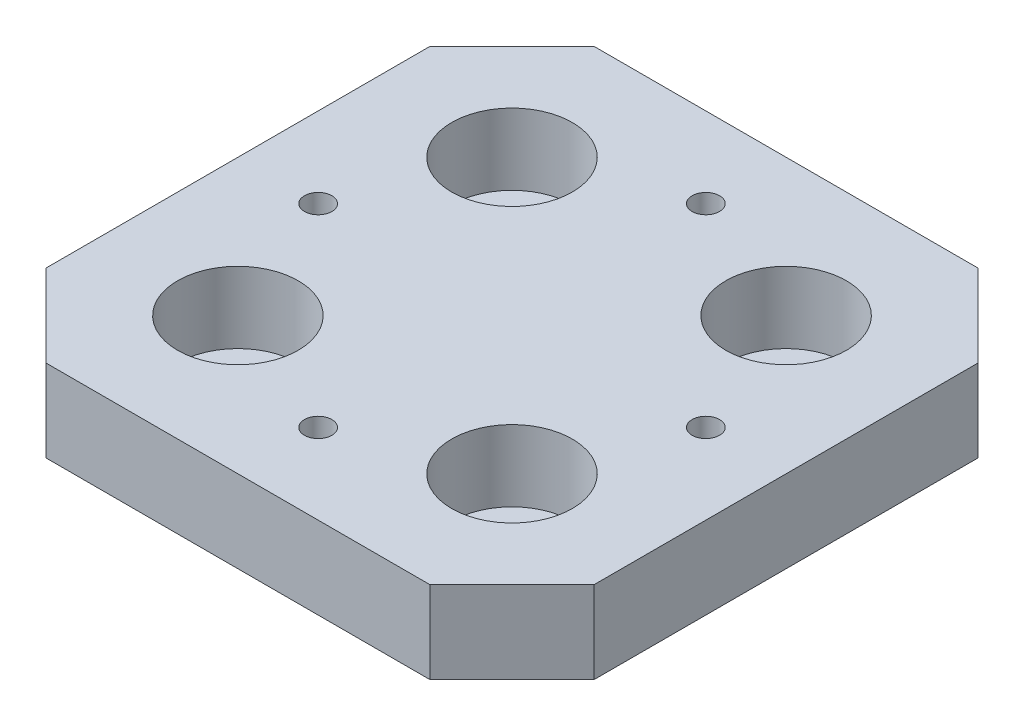
ISO-10303-21;
HEADER;
FILE_DESCRIPTION(('STEP AP214'),'2;1');
FILE_NAME('part.step','',(''),(''),'','','');
FILE_SCHEMA(('AUTOMOTIVE_DESIGN { 1 0 10303 214 1 1 1 1 }'));
ENDSEC;
DATA;
#1=APPLICATION_CONTEXT('core data for automotive mechanical design processes');
#2=APPLICATION_PROTOCOL_DEFINITION('international standard','automotive_design',2000,#1);
#3=PRODUCT_CONTEXT('',#1,'mechanical');
#4=PRODUCT('Part','Part','',(#3));
#5=PRODUCT_RELATED_PRODUCT_CATEGORY('part','',(#4));
#6=PRODUCT_DEFINITION_FORMATION('','',#4);
#7=PRODUCT_DEFINITION_CONTEXT('part definition',#1,'design');
#8=PRODUCT_DEFINITION('design','',#6,#7);
#9=PRODUCT_DEFINITION_SHAPE('','',#8);
#10=(LENGTH_UNIT() NAMED_UNIT(*) SI_UNIT(.MILLI.,.METRE.));
#11=(NAMED_UNIT(*) PLANE_ANGLE_UNIT() SI_UNIT($,.RADIAN.));
#12=(NAMED_UNIT(*) SI_UNIT($,.STERADIAN.) SOLID_ANGLE_UNIT());
#13=UNCERTAINTY_MEASURE_WITH_UNIT(LENGTH_MEASURE(1.E-05),#10,'distance_accuracy_value','');
#14=(GEOMETRIC_REPRESENTATION_CONTEXT(3) GLOBAL_UNCERTAINTY_ASSIGNED_CONTEXT((#13)) GLOBAL_UNIT_ASSIGNED_CONTEXT((#10,
#11,#12)) REPRESENTATION_CONTEXT('',''));
#15=CARTESIAN_POINT('',(0.,0.,0.));
#16=DIRECTION('',(0.,0.,1.));
#17=DIRECTION('',(1.,0.,0.));
#18=AXIS2_PLACEMENT_3D('',#15,#16,#17);
#19=CARTESIAN_POINT('',(0.,7.5,0.));
#20=DIRECTION('',(0.,-1.,0.));
#21=DIRECTION('',(0.,0.,-1.));
#22=AXIS2_PLACEMENT_3D('',#19,#20,#21);
#23=PLANE('',#22);
#24=CARTESIAN_POINT('',(-12.5,7.5,12.5));
#25=DIRECTION('',(0.,1.,0.));
#26=DIRECTION('',(0.,0.,1.));
#27=AXIS2_PLACEMENT_3D('',#24,#25,#26);
#28=CIRCLE('',#27,5.5);
#29=CARTESIAN_POINT('',(-12.5,7.5,18.));
#30=VERTEX_POINT('',#29);
#31=EDGE_CURVE('E229',#30,#30,#28,.T.);
#32=ORIENTED_EDGE('',*,*,#31,.F.);
#33=EDGE_LOOP('',(#32));
#34=FACE_BOUND('',#33,.T.);
#35=CARTESIAN_POINT('',(-12.5,7.5,-12.5));
#36=DIRECTION('',(0.,1.,0.));
#37=DIRECTION('',(0.,0.,1.));
#38=AXIS2_PLACEMENT_3D('',#35,#36,#37);
#39=CIRCLE('',#38,5.5);
#40=CARTESIAN_POINT('',(-12.5,7.5,-7.));
#41=VERTEX_POINT('',#40);
#42=EDGE_CURVE('E217',#41,#41,#39,.T.);
#43=ORIENTED_EDGE('',*,*,#42,.F.);
#44=EDGE_LOOP('',(#43));
#45=FACE_BOUND('',#44,.T.);
#46=CARTESIAN_POINT('',(12.5,7.5,-12.5));
#47=DIRECTION('',(0.,1.,0.));
#48=DIRECTION('',(0.,0.,1.));
#49=AXIS2_PLACEMENT_3D('',#46,#47,#48);
#50=CIRCLE('',#49,5.5);
#51=CARTESIAN_POINT('',(12.5,7.5,-7.));
#52=VERTEX_POINT('',#51);
#53=EDGE_CURVE('E205',#52,#52,#50,.T.);
#54=ORIENTED_EDGE('',*,*,#53,.F.);
#55=EDGE_LOOP('',(#54));
#56=FACE_BOUND('',#55,.T.);
#57=CARTESIAN_POINT('',(12.5,7.5,12.5));
#58=DIRECTION('',(0.,1.,0.));
#59=DIRECTION('',(0.,0.,1.));
#60=AXIS2_PLACEMENT_3D('',#57,#58,#59);
#61=CIRCLE('',#60,5.5);
#62=CARTESIAN_POINT('',(12.5,7.5,18.));
#63=VERTEX_POINT('',#62);
#64=EDGE_CURVE('E191',#63,#63,#61,.T.);
#65=ORIENTED_EDGE('',*,*,#64,.F.);
#66=EDGE_LOOP('',(#65));
#67=FACE_BOUND('',#66,.T.);
#68=DIRECTION('',(-1.,0.,0.));
#69=VECTOR('',#68,1.);
#70=CARTESIAN_POINT('',(-25.,7.5,-25.));
#71=LINE('',#70,#69);
#72=CARTESIAN_POINT('',(17.5,7.5,-25.));
#73=VERTEX_POINT('',#72);
#74=CARTESIAN_POINT('',(-17.5,7.5,-25.));
#75=VERTEX_POINT('',#74);
#76=EDGE_CURVE('E173',#73,#75,#71,.T.);
#77=ORIENTED_EDGE('',*,*,#76,.T.);
#78=DIRECTION('',(0.707106781186549,0.,-0.707106781186546));
#79=VECTOR('',#78,1.);
#80=CARTESIAN_POINT('',(-25.,7.5,-17.5));
#81=LINE('',#80,#79);
#82=CARTESIAN_POINT('',(-25.,7.5,-17.5));
#83=VERTEX_POINT('',#82);
#84=EDGE_CURVE('E151',#75,#83,#81,.F.);
#85=ORIENTED_EDGE('',*,*,#84,.T.);
#86=DIRECTION('',(0.,0.,1.));
#87=VECTOR('',#86,1.);
#88=CARTESIAN_POINT('',(-25.,7.5,25.));
#89=LINE('',#88,#87);
#90=CARTESIAN_POINT('',(-25.,7.5,17.5));
#91=VERTEX_POINT('',#90);
#92=EDGE_CURVE('E122',#83,#91,#89,.T.);
#93=ORIENTED_EDGE('',*,*,#92,.T.);
#94=DIRECTION('',(-0.707106781186546,0.,-0.707106781186549));
#95=VECTOR('',#94,1.);
#96=CARTESIAN_POINT('',(-17.5,7.5,25.));
#97=LINE('',#96,#95);
#98=CARTESIAN_POINT('',(-17.5,7.5,25.));
#99=VERTEX_POINT('',#98);
#100=EDGE_CURVE('E58',#91,#99,#97,.F.);
#101=ORIENTED_EDGE('',*,*,#100,.T.);
#102=DIRECTION('',(1.,0.,0.));
#103=VECTOR('',#102,1.);
#104=CARTESIAN_POINT('',(-25.,7.5,25.));
#105=LINE('',#104,#103);
#106=CARTESIAN_POINT('',(17.5,7.5,25.));
#107=VERTEX_POINT('',#106);
#108=EDGE_CURVE('E137',#99,#107,#105,.T.);
#109=ORIENTED_EDGE('',*,*,#108,.T.);
#110=DIRECTION('',(-0.707106781186549,0.,0.707106781186546));
#111=VECTOR('',#110,1.);
#112=CARTESIAN_POINT('',(25.,7.5,17.5));
#113=LINE('',#112,#111);
#114=CARTESIAN_POINT('',(25.,7.5,17.5));
#115=VERTEX_POINT('',#114);
#116=EDGE_CURVE('E147',#107,#115,#113,.F.);
#117=ORIENTED_EDGE('',*,*,#116,.T.);
#118=DIRECTION('',(0.,0.,-1.));
#119=VECTOR('',#118,1.);
#120=CARTESIAN_POINT('',(25.,7.5,25.));
#121=LINE('',#120,#119);
#122=CARTESIAN_POINT('',(25.,7.5,-17.5));
#123=VERTEX_POINT('',#122);
#124=EDGE_CURVE('E131',#115,#123,#121,.T.);
#125=ORIENTED_EDGE('',*,*,#124,.T.);
#126=DIRECTION('',(0.707106781186546,0.,0.707106781186549));
#127=VECTOR('',#126,1.);
#128=CARTESIAN_POINT('',(17.5,7.5,-25.));
#129=LINE('',#128,#127);
#130=EDGE_CURVE('E149',#123,#73,#129,.F.);
#131=ORIENTED_EDGE('',*,*,#130,.T.);
#132=EDGE_LOOP('',(#77,#85,#93,#101,#109,#117,#125,#131));
#133=FACE_BOUND('',#132,.T.);
#134=CARTESIAN_POINT('',(17.6776695296637,7.5,0.));
#135=DIRECTION('',(0.,1.,0.));
#136=DIRECTION('',(0.,0.,1.));
#137=AXIS2_PLACEMENT_3D('',#134,#135,#136);
#138=CIRCLE('',#137,1.25);
#139=CARTESIAN_POINT('',(17.6776695296637,7.5,1.25));
#140=VERTEX_POINT('',#139);
#141=EDGE_CURVE('E235',#140,#140,#138,.T.);
#142=ORIENTED_EDGE('',*,*,#141,.F.);
#143=EDGE_LOOP('',(#142));
#144=FACE_BOUND('',#143,.T.);
#145=CARTESIAN_POINT('',(0.,7.5,17.6776695296637));
#146=DIRECTION('',(0.,1.,0.));
#147=DIRECTION('',(0.,0.,1.));
#148=AXIS2_PLACEMENT_3D('',#145,#146,#147);
#149=CIRCLE('',#148,1.25);
#150=CARTESIAN_POINT('',(0.,7.5,18.9276695296637));
#151=VERTEX_POINT('',#150);
#152=EDGE_CURVE('E241',#151,#151,#149,.T.);
#153=ORIENTED_EDGE('',*,*,#152,.F.);
#154=EDGE_LOOP('',(#153));
#155=FACE_BOUND('',#154,.T.);
#156=CARTESIAN_POINT('',(-17.6776695296637,7.5,0.));
#157=DIRECTION('',(0.,1.,0.));
#158=DIRECTION('',(0.,0.,1.));
#159=AXIS2_PLACEMENT_3D('',#156,#157,#158);
#160=CIRCLE('',#159,1.25);
#161=CARTESIAN_POINT('',(-17.6776695296637,7.5,1.25));
#162=VERTEX_POINT('',#161);
#163=EDGE_CURVE('E247',#162,#162,#160,.T.);
#164=ORIENTED_EDGE('',*,*,#163,.F.);
#165=EDGE_LOOP('',(#164));
#166=FACE_BOUND('',#165,.T.);
#167=CARTESIAN_POINT('',(0.,7.5,-17.6776695296637));
#168=DIRECTION('',(0.,1.,0.));
#169=DIRECTION('',(0.,0.,1.));
#170=AXIS2_PLACEMENT_3D('',#167,#168,#169);
#171=CIRCLE('',#170,1.25);
#172=CARTESIAN_POINT('',(0.,7.5,-16.4276695296637));
#173=VERTEX_POINT('',#172);
#174=EDGE_CURVE('E253',#173,#173,#171,.T.);
#175=ORIENTED_EDGE('',*,*,#174,.F.);
#176=EDGE_LOOP('',(#175));
#177=FACE_BOUND('',#176,.T.);
#178=ADVANCED_FACE('F38',(#34,#45,#56,#67,#133,#144,#155,#166,#177),#23,.F.);
#179=CARTESIAN_POINT('',(25.,7.5,25.));
#180=DIRECTION('',(-1.,0.,0.));
#181=DIRECTION('',(0.,0.,1.));
#182=AXIS2_PLACEMENT_3D('',#179,#180,#181);
#183=PLANE('',#182);
#184=DIRECTION('',(0.,0.,-1.));
#185=VECTOR('',#184,1.);
#186=CARTESIAN_POINT('',(25.,0.,25.));
#187=LINE('',#186,#185);
#188=CARTESIAN_POINT('',(25.,0.,17.5));
#189=VERTEX_POINT('',#188);
#190=CARTESIAN_POINT('',(25.,0.,-17.5));
#191=VERTEX_POINT('',#190);
#192=EDGE_CURVE('E133',#189,#191,#187,.T.);
#193=ORIENTED_EDGE('',*,*,#192,.T.);
#194=DIRECTION('',(0.,1.,0.));
#195=VECTOR('',#194,1.);
#196=CARTESIAN_POINT('',(25.,7.5,-17.5));
#197=LINE('',#196,#195);
#198=EDGE_CURVE('E156',#191,#123,#197,.T.);
#199=ORIENTED_EDGE('',*,*,#198,.T.);
#200=ORIENTED_EDGE('',*,*,#124,.F.);
#201=DIRECTION('',(0.,-1.,0.));
#202=VECTOR('',#201,1.);
#203=CARTESIAN_POINT('',(25.,7.5,17.5));
#204=LINE('',#203,#202);
#205=EDGE_CURVE('E153',#115,#189,#204,.T.);
#206=ORIENTED_EDGE('',*,*,#205,.T.);
#207=EDGE_LOOP('',(#193,#199,#200,#206));
#208=FACE_BOUND('',#207,.T.);
#209=ADVANCED_FACE('F169',(#208),#183,.F.);
#210=CARTESIAN_POINT('',(-25.,7.5,-25.));
#211=DIRECTION('',(0.,0.,1.));
#212=DIRECTION('',(1.,0.,0.));
#213=AXIS2_PLACEMENT_3D('',#210,#211,#212);
#214=PLANE('',#213);
#215=DIRECTION('',(-1.,0.,0.));
#216=VECTOR('',#215,1.);
#217=CARTESIAN_POINT('',(-25.,0.,-25.));
#218=LINE('',#217,#216);
#219=CARTESIAN_POINT('',(17.5,0.,-25.));
#220=VERTEX_POINT('',#219);
#221=CARTESIAN_POINT('',(-17.5,0.,-25.));
#222=VERTEX_POINT('',#221);
#223=EDGE_CURVE('E129',#220,#222,#218,.T.);
#224=ORIENTED_EDGE('',*,*,#223,.T.);
#225=DIRECTION('',(0.,1.,0.));
#226=VECTOR('',#225,1.);
#227=CARTESIAN_POINT('',(-17.5,7.5,-25.));
#228=LINE('',#227,#226);
#229=EDGE_CURVE('E108',#222,#75,#228,.T.);
#230=ORIENTED_EDGE('',*,*,#229,.T.);
#231=ORIENTED_EDGE('',*,*,#76,.F.);
#232=DIRECTION('',(0.,-1.,0.));
#233=VECTOR('',#232,1.);
#234=CARTESIAN_POINT('',(17.5,7.5,-25.));
#235=LINE('',#234,#233);
#236=EDGE_CURVE('E113',#73,#220,#235,.T.);
#237=ORIENTED_EDGE('',*,*,#236,.T.);
#238=EDGE_LOOP('',(#224,#230,#231,#237));
#239=FACE_BOUND('',#238,.T.);
#240=ADVANCED_FACE('F266',(#239),#214,.F.);
#241=CARTESIAN_POINT('',(-25.,7.5,25.));
#242=DIRECTION('',(1.,0.,0.));
#243=DIRECTION('',(0.,0.,-1.));
#244=AXIS2_PLACEMENT_3D('',#241,#242,#243);
#245=PLANE('',#244);
#246=ORIENTED_EDGE('',*,*,#92,.F.);
#247=DIRECTION('',(0.,-1.,0.));
#248=VECTOR('',#247,1.);
#249=CARTESIAN_POINT('',(-25.,7.5,-17.5));
#250=LINE('',#249,#248);
#251=CARTESIAN_POINT('',(-25.,0.,-17.5));
#252=VERTEX_POINT('',#251);
#253=EDGE_CURVE('E107',#83,#252,#250,.T.);
#254=ORIENTED_EDGE('',*,*,#253,.T.);
#255=DIRECTION('',(0.,0.,1.));
#256=VECTOR('',#255,1.);
#257=CARTESIAN_POINT('',(-25.,0.,25.));
#258=LINE('',#257,#256);
#259=CARTESIAN_POINT('',(-25.,0.,17.5));
#260=VERTEX_POINT('',#259);
#261=EDGE_CURVE('E120',#252,#260,#258,.T.);
#262=ORIENTED_EDGE('',*,*,#261,.T.);
#263=DIRECTION('',(0.,1.,0.));
#264=VECTOR('',#263,1.);
#265=CARTESIAN_POINT('',(-25.,7.5,17.5));
#266=LINE('',#265,#264);
#267=EDGE_CURVE('E124',#260,#91,#266,.T.);
#268=ORIENTED_EDGE('',*,*,#267,.T.);
#269=EDGE_LOOP('',(#246,#254,#262,#268));
#270=FACE_BOUND('',#269,.T.);
#271=ADVANCED_FACE('F119',(#270),#245,.F.);
#272=CARTESIAN_POINT('',(-25.,7.5,25.));
#273=DIRECTION('',(0.,0.,-1.));
#274=DIRECTION('',(-1.,0.,0.));
#275=AXIS2_PLACEMENT_3D('',#272,#273,#274);
#276=PLANE('',#275);
#277=DIRECTION('',(1.,0.,0.));
#278=VECTOR('',#277,1.);
#279=CARTESIAN_POINT('',(-25.,0.,25.));
#280=LINE('',#279,#278);
#281=CARTESIAN_POINT('',(-17.5,0.,25.));
#282=VERTEX_POINT('',#281);
#283=CARTESIAN_POINT('',(17.5,0.,25.));
#284=VERTEX_POINT('',#283);
#285=EDGE_CURVE('E128',#282,#284,#280,.T.);
#286=ORIENTED_EDGE('',*,*,#285,.T.);
#287=DIRECTION('',(0.,1.,0.));
#288=VECTOR('',#287,1.);
#289=CARTESIAN_POINT('',(17.5,7.5,25.));
#290=LINE('',#289,#288);
#291=EDGE_CURVE('E11',#284,#107,#290,.T.);
#292=ORIENTED_EDGE('',*,*,#291,.T.);
#293=ORIENTED_EDGE('',*,*,#108,.F.);
#294=DIRECTION('',(0.,-1.,0.));
#295=VECTOR('',#294,1.);
#296=CARTESIAN_POINT('',(-17.5,7.5,25.));
#297=LINE('',#296,#295);
#298=EDGE_CURVE('E46',#99,#282,#297,.T.);
#299=ORIENTED_EDGE('',*,*,#298,.T.);
#300=EDGE_LOOP('',(#286,#292,#293,#299));
#301=FACE_BOUND('',#300,.T.);
#302=ADVANCED_FACE('F159',(#301),#276,.F.);
#303=CARTESIAN_POINT('',(0.,0.,0.));
#304=DIRECTION('',(0.,-1.,0.));
#305=DIRECTION('',(0.,0.,-1.));
#306=AXIS2_PLACEMENT_3D('',#303,#304,#305);
#307=PLANE('',#306);
#308=CARTESIAN_POINT('',(0.,0.,-17.6776695296637));
#309=DIRECTION('',(0.,-1.,0.));
#310=DIRECTION('',(0.,0.,-1.));
#311=AXIS2_PLACEMENT_3D('',#308,#309,#310);
#312=CIRCLE('',#311,1.25);
#313=CARTESIAN_POINT('',(0.,0.,-18.9276695296637));
#314=VERTEX_POINT('',#313);
#315=EDGE_CURVE('E250',#314,#314,#312,.T.);
#316=ORIENTED_EDGE('',*,*,#315,.F.);
#317=EDGE_LOOP('',(#316));
#318=FACE_BOUND('',#317,.T.);
#319=CARTESIAN_POINT('',(-17.6776695296637,0.,0.));
#320=DIRECTION('',(0.,-1.,0.));
#321=DIRECTION('',(0.,0.,-1.));
#322=AXIS2_PLACEMENT_3D('',#319,#320,#321);
#323=CIRCLE('',#322,1.25);
#324=CARTESIAN_POINT('',(-17.6776695296637,0.,-1.25));
#325=VERTEX_POINT('',#324);
#326=EDGE_CURVE('E244',#325,#325,#323,.T.);
#327=ORIENTED_EDGE('',*,*,#326,.F.);
#328=EDGE_LOOP('',(#327));
#329=FACE_BOUND('',#328,.T.);
#330=CARTESIAN_POINT('',(0.,0.,17.6776695296637));
#331=DIRECTION('',(0.,-1.,0.));
#332=DIRECTION('',(0.,0.,-1.));
#333=AXIS2_PLACEMENT_3D('',#330,#331,#332);
#334=CIRCLE('',#333,1.25);
#335=CARTESIAN_POINT('',(0.,0.,16.4276695296637));
#336=VERTEX_POINT('',#335);
#337=EDGE_CURVE('E238',#336,#336,#334,.T.);
#338=ORIENTED_EDGE('',*,*,#337,.F.);
#339=EDGE_LOOP('',(#338));
#340=FACE_BOUND('',#339,.T.);
#341=CARTESIAN_POINT('',(17.6776695296637,0.,0.));
#342=DIRECTION('',(0.,-1.,0.));
#343=DIRECTION('',(0.,0.,-1.));
#344=AXIS2_PLACEMENT_3D('',#341,#342,#343);
#345=CIRCLE('',#344,1.25);
#346=CARTESIAN_POINT('',(17.6776695296637,0.,-1.25));
#347=VERTEX_POINT('',#346);
#348=EDGE_CURVE('E232',#347,#347,#345,.T.);
#349=ORIENTED_EDGE('',*,*,#348,.F.);
#350=EDGE_LOOP('',(#349));
#351=FACE_BOUND('',#350,.T.);
#352=CARTESIAN_POINT('',(-12.5,0.,12.5));
#353=DIRECTION('',(0.,-1.,0.));
#354=DIRECTION('',(0.,0.,-1.));
#355=AXIS2_PLACEMENT_3D('',#352,#353,#354);
#356=CIRCLE('',#355,3.3);
#357=CARTESIAN_POINT('',(-12.5,0.,9.2));
#358=VERTEX_POINT('',#357);
#359=EDGE_CURVE('E220',#358,#358,#356,.T.);
#360=ORIENTED_EDGE('',*,*,#359,.F.);
#361=EDGE_LOOP('',(#360));
#362=FACE_BOUND('',#361,.T.);
#363=CARTESIAN_POINT('',(-12.5,0.,-12.5));
#364=DIRECTION('',(0.,-1.,0.));
#365=DIRECTION('',(0.,0.,-1.));
#366=AXIS2_PLACEMENT_3D('',#363,#364,#365);
#367=CIRCLE('',#366,3.3);
#368=CARTESIAN_POINT('',(-12.5,0.,-15.8));
#369=VERTEX_POINT('',#368);
#370=EDGE_CURVE('E208',#369,#369,#367,.T.);
#371=ORIENTED_EDGE('',*,*,#370,.F.);
#372=EDGE_LOOP('',(#371));
#373=FACE_BOUND('',#372,.T.);
#374=CARTESIAN_POINT('',(12.5,0.,-12.5));
#375=DIRECTION('',(0.,-1.,0.));
#376=DIRECTION('',(0.,0.,-1.));
#377=AXIS2_PLACEMENT_3D('',#374,#375,#376);
#378=CIRCLE('',#377,3.3);
#379=CARTESIAN_POINT('',(12.5,0.,-15.8));
#380=VERTEX_POINT('',#379);
#381=EDGE_CURVE('E196',#380,#380,#378,.T.);
#382=ORIENTED_EDGE('',*,*,#381,.F.);
#383=EDGE_LOOP('',(#382));
#384=FACE_BOUND('',#383,.T.);
#385=CARTESIAN_POINT('',(12.5,0.,12.5));
#386=DIRECTION('',(0.,-1.,0.));
#387=DIRECTION('',(0.,0.,-1.));
#388=AXIS2_PLACEMENT_3D('',#385,#386,#387);
#389=CIRCLE('',#388,3.3);
#390=CARTESIAN_POINT('',(12.5,0.,9.2));
#391=VERTEX_POINT('',#390);
#392=EDGE_CURVE('E178',#391,#391,#389,.T.);
#393=ORIENTED_EDGE('',*,*,#392,.F.);
#394=EDGE_LOOP('',(#393));
#395=FACE_BOUND('',#394,.T.);
#396=ORIENTED_EDGE('',*,*,#261,.F.);
#397=DIRECTION('',(-0.707106781186549,0.,0.707106781186546));
#398=VECTOR('',#397,1.);
#399=CARTESIAN_POINT('',(-21.2499999999999,0.,-21.25));
#400=LINE('',#399,#398);
#401=EDGE_CURVE('E103',#252,#222,#400,.F.);
#402=ORIENTED_EDGE('',*,*,#401,.T.);
#403=ORIENTED_EDGE('',*,*,#223,.F.);
#404=DIRECTION('',(-0.707106781186546,0.,-0.707106781186549));
#405=VECTOR('',#404,1.);
#406=CARTESIAN_POINT('',(21.25,0.,-21.2499999999999));
#407=LINE('',#406,#405);
#408=EDGE_CURVE('E114',#220,#191,#407,.F.);
#409=ORIENTED_EDGE('',*,*,#408,.T.);
#410=ORIENTED_EDGE('',*,*,#192,.F.);
#411=DIRECTION('',(0.707106781186549,0.,-0.707106781186546));
#412=VECTOR('',#411,1.);
#413=CARTESIAN_POINT('',(21.2499999999999,0.,21.25));
#414=LINE('',#413,#412);
#415=EDGE_CURVE('E140',#189,#284,#414,.F.);
#416=ORIENTED_EDGE('',*,*,#415,.T.);
#417=ORIENTED_EDGE('',*,*,#285,.F.);
#418=DIRECTION('',(0.707106781186546,0.,0.707106781186549));
#419=VECTOR('',#418,1.);
#420=CARTESIAN_POINT('',(-21.25,0.,21.2499999999999));
#421=LINE('',#420,#419);
#422=EDGE_CURVE('E123',#282,#260,#421,.F.);
#423=ORIENTED_EDGE('',*,*,#422,.T.);
#424=EDGE_LOOP('',(#396,#402,#403,#409,#410,#416,#417,#423));
#425=FACE_BOUND('',#424,.T.);
#426=ADVANCED_FACE('F126',(#318,#329,#340,#351,#362,#373,#384,#395,#425),#307,.T.);
#427=CARTESIAN_POINT('',(12.5,7.5,12.5));
#428=DIRECTION('',(0.,1.,0.));
#429=DIRECTION('',(0.,0.,1.));
#430=AXIS2_PLACEMENT_3D('',#427,#428,#429);
#431=CYLINDRICAL_SURFACE('',#430,3.3);
#432=CARTESIAN_POINT('',(12.5,0.999999999999999,12.5));
#433=DIRECTION('',(0.,1.,0.));
#434=DIRECTION('',(0.,0.,1.));
#435=AXIS2_PLACEMENT_3D('',#432,#433,#434);
#436=CIRCLE('',#435,3.3);
#437=CARTESIAN_POINT('',(12.5,0.999999999999999,15.8));
#438=VERTEX_POINT('',#437);
#439=EDGE_CURVE('E183',#438,#438,#436,.T.);
#440=ORIENTED_EDGE('',*,*,#439,.T.);
#441=EDGE_LOOP('',(#440));
#442=FACE_BOUND('',#441,.T.);
#443=ORIENTED_EDGE('',*,*,#392,.T.);
#444=EDGE_LOOP('',(#443));
#445=FACE_BOUND('',#444,.T.);
#446=ADVANCED_FACE('F272',(#442,#445),#431,.F.);
#447=CARTESIAN_POINT('',(15.8,0.999999999999999,12.5));
#448=DIRECTION('',(0.,-1.,0.));
#449=DIRECTION('',(0.,0.,-1.));
#450=AXIS2_PLACEMENT_3D('',#447,#448,#449);
#451=PLANE('',#450);
#452=ORIENTED_EDGE('',*,*,#439,.F.);
#453=EDGE_LOOP('',(#452));
#454=FACE_BOUND('',#453,.T.);
#455=CARTESIAN_POINT('',(12.5,0.999999999999999,12.5));
#456=DIRECTION('',(0.,1.,0.));
#457=DIRECTION('',(0.,0.,1.));
#458=AXIS2_PLACEMENT_3D('',#455,#456,#457);
#459=CIRCLE('',#458,5.5);
#460=CARTESIAN_POINT('',(12.5,0.999999999999999,18.));
#461=VERTEX_POINT('',#460);
#462=EDGE_CURVE('E187',#461,#461,#459,.T.);
#463=ORIENTED_EDGE('',*,*,#462,.T.);
#464=EDGE_LOOP('',(#463));
#465=FACE_BOUND('',#464,.T.);
#466=ADVANCED_FACE('F336',(#454,#465),#451,.F.);
#467=CARTESIAN_POINT('',(12.5,7.5,12.5));
#468=DIRECTION('',(0.,1.,0.));
#469=DIRECTION('',(0.,0.,1.));
#470=AXIS2_PLACEMENT_3D('',#467,#468,#469);
#471=CYLINDRICAL_SURFACE('',#470,5.5);
#472=ORIENTED_EDGE('',*,*,#462,.F.);
#473=EDGE_LOOP('',(#472));
#474=FACE_BOUND('',#473,.T.);
#475=ORIENTED_EDGE('',*,*,#64,.T.);
#476=EDGE_LOOP('',(#475));
#477=FACE_BOUND('',#476,.T.);
#478=ADVANCED_FACE('F326',(#474,#477),#471,.F.);
#479=CARTESIAN_POINT('',(12.5,7.5,-12.5));
#480=DIRECTION('',(0.,1.,0.));
#481=DIRECTION('',(0.,0.,1.));
#482=AXIS2_PLACEMENT_3D('',#479,#480,#481);
#483=CYLINDRICAL_SURFACE('',#482,3.3);
#484=CARTESIAN_POINT('',(12.5,0.999999999999999,-12.5));
#485=DIRECTION('',(0.,1.,0.));
#486=DIRECTION('',(0.,0.,1.));
#487=AXIS2_PLACEMENT_3D('',#484,#485,#486);
#488=CIRCLE('',#487,3.3);
#489=CARTESIAN_POINT('',(12.5,0.999999999999999,-9.2));
#490=VERTEX_POINT('',#489);
#491=EDGE_CURVE('E199',#490,#490,#488,.T.);
#492=ORIENTED_EDGE('',*,*,#491,.T.);
#493=EDGE_LOOP('',(#492));
#494=FACE_BOUND('',#493,.T.);
#495=ORIENTED_EDGE('',*,*,#381,.T.);
#496=EDGE_LOOP('',(#495));
#497=FACE_BOUND('',#496,.T.);
#498=ADVANCED_FACE('F323',(#494,#497),#483,.F.);
#499=CARTESIAN_POINT('',(15.8,0.999999999999999,-12.5));
#500=DIRECTION('',(0.,-1.,0.));
#501=DIRECTION('',(0.,0.,-1.));
#502=AXIS2_PLACEMENT_3D('',#499,#500,#501);
#503=PLANE('',#502);
#504=ORIENTED_EDGE('',*,*,#491,.F.);
#505=EDGE_LOOP('',(#504));
#506=FACE_BOUND('',#505,.T.);
#507=CARTESIAN_POINT('',(12.5,0.999999999999999,-12.5));
#508=DIRECTION('',(0.,1.,0.));
#509=DIRECTION('',(0.,0.,1.));
#510=AXIS2_PLACEMENT_3D('',#507,#508,#509);
#511=CIRCLE('',#510,5.5);
#512=CARTESIAN_POINT('',(12.5,0.999999999999999,-7.));
#513=VERTEX_POINT('',#512);
#514=EDGE_CURVE('E202',#513,#513,#511,.T.);
#515=ORIENTED_EDGE('',*,*,#514,.T.);
#516=EDGE_LOOP('',(#515));
#517=FACE_BOUND('',#516,.T.);
#518=ADVANCED_FACE('F325',(#506,#517),#503,.F.);
#519=CARTESIAN_POINT('',(12.5,7.5,-12.5));
#520=DIRECTION('',(0.,1.,0.));
#521=DIRECTION('',(0.,0.,1.));
#522=AXIS2_PLACEMENT_3D('',#519,#520,#521);
#523=CYLINDRICAL_SURFACE('',#522,5.5);
#524=ORIENTED_EDGE('',*,*,#514,.F.);
#525=EDGE_LOOP('',(#524));
#526=FACE_BOUND('',#525,.T.);
#527=ORIENTED_EDGE('',*,*,#53,.T.);
#528=EDGE_LOOP('',(#527));
#529=FACE_BOUND('',#528,.T.);
#530=ADVANCED_FACE('F333',(#526,#529),#523,.F.);
#531=CARTESIAN_POINT('',(-12.5,7.5,-12.5));
#532=DIRECTION('',(0.,1.,0.));
#533=DIRECTION('',(0.,0.,1.));
#534=AXIS2_PLACEMENT_3D('',#531,#532,#533);
#535=CYLINDRICAL_SURFACE('',#534,3.3);
#536=CARTESIAN_POINT('',(-12.5,0.999999999999999,-12.5));
#537=DIRECTION('',(0.,1.,0.));
#538=DIRECTION('',(0.,0.,1.));
#539=AXIS2_PLACEMENT_3D('',#536,#537,#538);
#540=CIRCLE('',#539,3.3);
#541=CARTESIAN_POINT('',(-12.5,0.999999999999999,-9.2));
#542=VERTEX_POINT('',#541);
#543=EDGE_CURVE('E211',#542,#542,#540,.T.);
#544=ORIENTED_EDGE('',*,*,#543,.T.);
#545=EDGE_LOOP('',(#544));
#546=FACE_BOUND('',#545,.T.);
#547=ORIENTED_EDGE('',*,*,#370,.T.);
#548=EDGE_LOOP('',(#547));
#549=FACE_BOUND('',#548,.T.);
#550=ADVANCED_FACE('F466',(#546,#549),#535,.F.);
#551=CARTESIAN_POINT('',(-9.2,0.999999999999999,-12.5));
#552=DIRECTION('',(0.,-1.,0.));
#553=DIRECTION('',(0.,0.,-1.));
#554=AXIS2_PLACEMENT_3D('',#551,#552,#553);
#555=PLANE('',#554);
#556=ORIENTED_EDGE('',*,*,#543,.F.);
#557=EDGE_LOOP('',(#556));
#558=FACE_BOUND('',#557,.T.);
#559=CARTESIAN_POINT('',(-12.5,0.999999999999999,-12.5));
#560=DIRECTION('',(0.,1.,0.));
#561=DIRECTION('',(0.,0.,1.));
#562=AXIS2_PLACEMENT_3D('',#559,#560,#561);
#563=CIRCLE('',#562,5.5);
#564=CARTESIAN_POINT('',(-12.5,0.999999999999999,-7.));
#565=VERTEX_POINT('',#564);
#566=EDGE_CURVE('E214',#565,#565,#563,.T.);
#567=ORIENTED_EDGE('',*,*,#566,.T.);
#568=EDGE_LOOP('',(#567));
#569=FACE_BOUND('',#568,.T.);
#570=ADVANCED_FACE('F456',(#558,#569),#555,.F.);
#571=CARTESIAN_POINT('',(-12.5,7.5,-12.5));
#572=DIRECTION('',(0.,1.,0.));
#573=DIRECTION('',(0.,0.,1.));
#574=AXIS2_PLACEMENT_3D('',#571,#572,#573);
#575=CYLINDRICAL_SURFACE('',#574,5.5);
#576=ORIENTED_EDGE('',*,*,#566,.F.);
#577=EDGE_LOOP('',(#576));
#578=FACE_BOUND('',#577,.T.);
#579=ORIENTED_EDGE('',*,*,#42,.T.);
#580=EDGE_LOOP('',(#579));
#581=FACE_BOUND('',#580,.T.);
#582=ADVANCED_FACE('F446',(#578,#581),#575,.F.);
#583=CARTESIAN_POINT('',(-12.5,7.5,12.5));
#584=DIRECTION('',(0.,1.,0.));
#585=DIRECTION('',(0.,0.,1.));
#586=AXIS2_PLACEMENT_3D('',#583,#584,#585);
#587=CYLINDRICAL_SURFACE('',#586,3.3);
#588=CARTESIAN_POINT('',(-12.5,0.999999999999999,12.5));
#589=DIRECTION('',(0.,1.,0.));
#590=DIRECTION('',(0.,0.,1.));
#591=AXIS2_PLACEMENT_3D('',#588,#589,#590);
#592=CIRCLE('',#591,3.3);
#593=CARTESIAN_POINT('',(-12.5,0.999999999999999,15.8));
#594=VERTEX_POINT('',#593);
#595=EDGE_CURVE('E223',#594,#594,#592,.T.);
#596=ORIENTED_EDGE('',*,*,#595,.T.);
#597=EDGE_LOOP('',(#596));
#598=FACE_BOUND('',#597,.T.);
#599=ORIENTED_EDGE('',*,*,#359,.T.);
#600=EDGE_LOOP('',(#599));
#601=FACE_BOUND('',#600,.T.);
#602=ADVANCED_FACE('F436',(#598,#601),#587,.F.);
#603=CARTESIAN_POINT('',(-9.2,0.999999999999999,12.5));
#604=DIRECTION('',(0.,-1.,0.));
#605=DIRECTION('',(0.,0.,-1.));
#606=AXIS2_PLACEMENT_3D('',#603,#604,#605);
#607=PLANE('',#606);
#608=ORIENTED_EDGE('',*,*,#595,.F.);
#609=EDGE_LOOP('',(#608));
#610=FACE_BOUND('',#609,.T.);
#611=CARTESIAN_POINT('',(-12.5,0.999999999999999,12.5));
#612=DIRECTION('',(0.,1.,0.));
#613=DIRECTION('',(0.,0.,1.));
#614=AXIS2_PLACEMENT_3D('',#611,#612,#613);
#615=CIRCLE('',#614,5.5);
#616=CARTESIAN_POINT('',(-12.5,0.999999999999999,18.));
#617=VERTEX_POINT('',#616);
#618=EDGE_CURVE('E226',#617,#617,#615,.T.);
#619=ORIENTED_EDGE('',*,*,#618,.T.);
#620=EDGE_LOOP('',(#619));
#621=FACE_BOUND('',#620,.T.);
#622=ADVANCED_FACE('F426',(#610,#621),#607,.F.);
#623=CARTESIAN_POINT('',(-12.5,7.5,12.5));
#624=DIRECTION('',(0.,1.,0.));
#625=DIRECTION('',(0.,0.,1.));
#626=AXIS2_PLACEMENT_3D('',#623,#624,#625);
#627=CYLINDRICAL_SURFACE('',#626,5.5);
#628=ORIENTED_EDGE('',*,*,#618,.F.);
#629=EDGE_LOOP('',(#628));
#630=FACE_BOUND('',#629,.T.);
#631=ORIENTED_EDGE('',*,*,#31,.T.);
#632=EDGE_LOOP('',(#631));
#633=FACE_BOUND('',#632,.T.);
#634=ADVANCED_FACE('F417',(#630,#633),#627,.F.);
#635=CARTESIAN_POINT('',(17.6776695296637,7.5,0.));
#636=DIRECTION('',(0.,1.,0.));
#637=DIRECTION('',(0.,0.,1.));
#638=AXIS2_PLACEMENT_3D('',#635,#636,#637);
#639=CYLINDRICAL_SURFACE('',#638,1.25);
#640=ORIENTED_EDGE('',*,*,#141,.T.);
#641=EDGE_LOOP('',(#640));
#642=FACE_BOUND('',#641,.T.);
#643=ORIENTED_EDGE('',*,*,#348,.T.);
#644=EDGE_LOOP('',(#643));
#645=FACE_BOUND('',#644,.T.);
#646=ADVANCED_FACE('F407',(#642,#645),#639,.F.);
#647=CARTESIAN_POINT('',(0.,7.5,17.6776695296637));
#648=DIRECTION('',(0.,1.,0.));
#649=DIRECTION('',(0.,0.,1.));
#650=AXIS2_PLACEMENT_3D('',#647,#648,#649);
#651=CYLINDRICAL_SURFACE('',#650,1.25);
#652=ORIENTED_EDGE('',*,*,#152,.T.);
#653=EDGE_LOOP('',(#652));
#654=FACE_BOUND('',#653,.T.);
#655=ORIENTED_EDGE('',*,*,#337,.T.);
#656=EDGE_LOOP('',(#655));
#657=FACE_BOUND('',#656,.T.);
#658=ADVANCED_FACE('F307',(#654,#657),#651,.F.);
#659=CARTESIAN_POINT('',(-17.6776695296637,7.5,0.));
#660=DIRECTION('',(0.,1.,0.));
#661=DIRECTION('',(0.,0.,1.));
#662=AXIS2_PLACEMENT_3D('',#659,#660,#661);
#663=CYLINDRICAL_SURFACE('',#662,1.25);
#664=ORIENTED_EDGE('',*,*,#163,.T.);
#665=EDGE_LOOP('',(#664));
#666=FACE_BOUND('',#665,.T.);
#667=ORIENTED_EDGE('',*,*,#326,.T.);
#668=EDGE_LOOP('',(#667));
#669=FACE_BOUND('',#668,.T.);
#670=ADVANCED_FACE('F304',(#666,#669),#663,.F.);
#671=CARTESIAN_POINT('',(0.,7.5,-17.6776695296637));
#672=DIRECTION('',(0.,1.,0.));
#673=DIRECTION('',(0.,0.,1.));
#674=AXIS2_PLACEMENT_3D('',#671,#672,#673);
#675=CYLINDRICAL_SURFACE('',#674,1.25);
#676=ORIENTED_EDGE('',*,*,#174,.T.);
#677=EDGE_LOOP('',(#676));
#678=FACE_BOUND('',#677,.T.);
#679=ORIENTED_EDGE('',*,*,#315,.T.);
#680=EDGE_LOOP('',(#679));
#681=FACE_BOUND('',#680,.T.);
#682=ADVANCED_FACE('F257',(#678,#681),#675,.F.);
#683=CARTESIAN_POINT('',(-25.,7.5,-17.5));
#684=DIRECTION('',(0.707106781186546,0.,0.707106781186549));
#685=DIRECTION('',(0.,-1.,0.));
#686=AXIS2_PLACEMENT_3D('',#683,#684,#685);
#687=PLANE('',#686);
#688=ORIENTED_EDGE('',*,*,#84,.F.);
#689=ORIENTED_EDGE('',*,*,#229,.F.);
#690=ORIENTED_EDGE('',*,*,#401,.F.);
#691=ORIENTED_EDGE('',*,*,#253,.F.);
#692=EDGE_LOOP('',(#688,#689,#690,#691));
#693=FACE_BOUND('',#692,.T.);
#694=ADVANCED_FACE('F106',(#693),#687,.F.);
#695=CARTESIAN_POINT('',(17.5,7.5,-25.));
#696=DIRECTION('',(-0.707106781186549,0.,0.707106781186546));
#697=DIRECTION('',(0.,-1.,0.));
#698=AXIS2_PLACEMENT_3D('',#695,#696,#697);
#699=PLANE('',#698);
#700=ORIENTED_EDGE('',*,*,#130,.F.);
#701=ORIENTED_EDGE('',*,*,#198,.F.);
#702=ORIENTED_EDGE('',*,*,#408,.F.);
#703=ORIENTED_EDGE('',*,*,#236,.F.);
#704=EDGE_LOOP('',(#700,#701,#702,#703));
#705=FACE_BOUND('',#704,.T.);
#706=ADVANCED_FACE('F286',(#705),#699,.F.);
#707=CARTESIAN_POINT('',(25.,7.5,17.5));
#708=DIRECTION('',(-0.707106781186546,0.,-0.707106781186549));
#709=DIRECTION('',(0.,-1.,0.));
#710=AXIS2_PLACEMENT_3D('',#707,#708,#709);
#711=PLANE('',#710);
#712=ORIENTED_EDGE('',*,*,#116,.F.);
#713=ORIENTED_EDGE('',*,*,#291,.F.);
#714=ORIENTED_EDGE('',*,*,#415,.F.);
#715=ORIENTED_EDGE('',*,*,#205,.F.);
#716=EDGE_LOOP('',(#712,#713,#714,#715));
#717=FACE_BOUND('',#716,.T.);
#718=ADVANCED_FACE('F166',(#717),#711,.F.);
#719=CARTESIAN_POINT('',(-17.5,7.5,25.));
#720=DIRECTION('',(0.707106781186549,0.,-0.707106781186546));
#721=DIRECTION('',(0.,-1.,0.));
#722=AXIS2_PLACEMENT_3D('',#719,#720,#721);
#723=PLANE('',#722);
#724=ORIENTED_EDGE('',*,*,#100,.F.);
#725=ORIENTED_EDGE('',*,*,#267,.F.);
#726=ORIENTED_EDGE('',*,*,#422,.F.);
#727=ORIENTED_EDGE('',*,*,#298,.F.);
#728=EDGE_LOOP('',(#724,#725,#726,#727));
#729=FACE_BOUND('',#728,.T.);
#730=ADVANCED_FACE('F40',(#729),#723,.F.);
#731=CLOSED_SHELL('',(#178,#209,#240,#271,#302,#426,#446,#466,#478,#498,#518,#530,#550,#570,
#582,#602,#622,#634,#646,#658,#670,#682,#694,#706,#718,#730));
#732=MANIFOLD_SOLID_BREP('B2',#731);
#733=ADVANCED_BREP_SHAPE_REPRESENTATION('',(#18,#732),#14);
#734=SHAPE_DEFINITION_REPRESENTATION(#9,#733);
ENDSEC;
END-ISO-10303-21;
